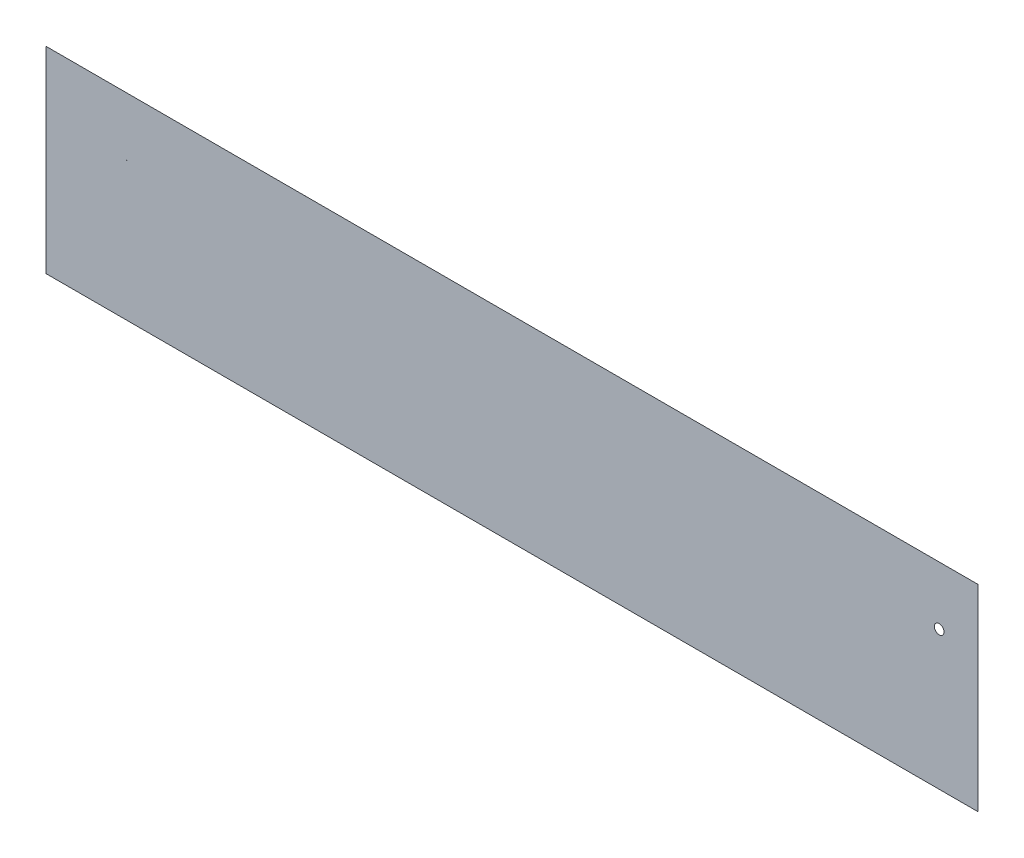
ISO-10303-21;
HEADER;
FILE_DESCRIPTION(('STEP AP214'),'2;1');
FILE_NAME('part.step','',(''),(''),'','','');
FILE_SCHEMA(('AUTOMOTIVE_DESIGN { 1 0 10303 214 1 1 1 1 }'));
ENDSEC;
DATA;
#1=APPLICATION_CONTEXT('core data for automotive mechanical design processes');
#2=APPLICATION_PROTOCOL_DEFINITION('international standard','automotive_design',2000,#1);
#3=PRODUCT_CONTEXT('',#1,'mechanical');
#4=PRODUCT('Part','Part','',(#3));
#5=PRODUCT_RELATED_PRODUCT_CATEGORY('part','',(#4));
#6=PRODUCT_DEFINITION_FORMATION('','',#4);
#7=PRODUCT_DEFINITION_CONTEXT('part definition',#1,'design');
#8=PRODUCT_DEFINITION('design','',#6,#7);
#9=PRODUCT_DEFINITION_SHAPE('','',#8);
#10=(LENGTH_UNIT() NAMED_UNIT(*) SI_UNIT(.MILLI.,.METRE.));
#11=(NAMED_UNIT(*) PLANE_ANGLE_UNIT() SI_UNIT($,.RADIAN.));
#12=(NAMED_UNIT(*) SI_UNIT($,.STERADIAN.) SOLID_ANGLE_UNIT());
#13=UNCERTAINTY_MEASURE_WITH_UNIT(LENGTH_MEASURE(1.E-05),#10,'distance_accuracy_value','');
#14=(GEOMETRIC_REPRESENTATION_CONTEXT(3) GLOBAL_UNCERTAINTY_ASSIGNED_CONTEXT((#13)) GLOBAL_UNIT_ASSIGNED_CONTEXT((#10,
#11,#12)) REPRESENTATION_CONTEXT('',''));
#15=CARTESIAN_POINT('',(0.,0.,0.));
#16=DIRECTION('',(0.,0.,1.));
#17=DIRECTION('',(1.,0.,0.));
#18=AXIS2_PLACEMENT_3D('',#15,#16,#17);
#19=CARTESIAN_POINT('',(0.,0.,0.000100076));
#20=DIRECTION('',(0.,0.,-1.));
#21=DIRECTION('',(-1.,0.,0.));
#22=AXIS2_PLACEMENT_3D('',#19,#20,#21);
#23=PLANE('',#22);
#24=DIRECTION('',(0.,-1.,0.));
#25=VECTOR('',#24,1.);
#26=CARTESIAN_POINT('',(0.,0.,0.000100076));
#27=LINE('',#26,#25);
#28=CARTESIAN_POINT('',(0.,128.778,0.000100076));
#29=VERTEX_POINT('',#28);
#30=CARTESIAN_POINT('',(0.,0.,0.000100076));
#31=VERTEX_POINT('',#30);
#32=EDGE_CURVE('E87',#29,#31,#27,.T.);
#33=ORIENTED_EDGE('',*,*,#32,.T.);
#34=DIRECTION('',(1.,0.,0.));
#35=VECTOR('',#34,1.);
#36=CARTESIAN_POINT('',(0.,0.,0.000100076));
#37=LINE('',#36,#35);
#38=CARTESIAN_POINT('',(609.6,0.,0.000100076));
#39=VERTEX_POINT('',#38);
#40=EDGE_CURVE('E82',#31,#39,#37,.T.);
#41=ORIENTED_EDGE('',*,*,#40,.T.);
#42=DIRECTION('',(0.,1.,0.));
#43=VECTOR('',#42,1.);
#44=CARTESIAN_POINT('',(609.6,0.,0.000100076));
#45=LINE('',#44,#43);
#46=CARTESIAN_POINT('',(609.6,128.778,0.000100076));
#47=VERTEX_POINT('',#46);
#48=EDGE_CURVE('E85',#39,#47,#45,.T.);
#49=ORIENTED_EDGE('',*,*,#48,.T.);
#50=DIRECTION('',(-1.,0.,0.));
#51=VECTOR('',#50,1.);
#52=CARTESIAN_POINT('',(0.,128.778,0.000100076));
#53=LINE('',#52,#51);
#54=EDGE_CURVE('E52',#47,#29,#53,.T.);
#55=ORIENTED_EDGE('',*,*,#54,.T.);
#56=EDGE_LOOP('',(#33,#41,#49,#55));
#57=FACE_BOUND('',#56,.T.);
#58=CARTESIAN_POINT('',(52.9746921364165,90.678,0.000100076));
#59=DIRECTION('',(0.,0.,1.));
#60=DIRECTION('',(1.,0.,0.));
#61=AXIS2_PLACEMENT_3D('',#58,#59,#60);
#62=CIRCLE('',#61,0.174798991152219);
#63=CARTESIAN_POINT('',(53.1494911275687,90.678,0.000100076));
#64=VERTEX_POINT('',#63);
#65=EDGE_CURVE('E102',#64,#64,#62,.T.);
#66=ORIENTED_EDGE('',*,*,#65,.F.);
#67=EDGE_LOOP('',(#66));
#68=FACE_BOUND('',#67,.T.);
#69=CARTESIAN_POINT('',(584.2,90.678,0.000100076));
#70=DIRECTION('',(0.,0.,1.));
#71=DIRECTION('',(1.,0.,0.));
#72=AXIS2_PLACEMENT_3D('',#69,#70,#71);
#73=CIRCLE('',#72,3.17500000000008);
#74=CARTESIAN_POINT('',(587.375,90.678,0.000100076));
#75=VERTEX_POINT('',#74);
#76=EDGE_CURVE('E117',#75,#75,#73,.T.);
#77=ORIENTED_EDGE('',*,*,#76,.F.);
#78=EDGE_LOOP('',(#77));
#79=FACE_BOUND('',#78,.T.);
#80=ADVANCED_FACE('F35',(#57,#68,#79),#23,.F.);
#81=CARTESIAN_POINT('',(0.,0.,0.));
#82=DIRECTION('',(0.,0.,-1.));
#83=DIRECTION('',(-1.,0.,0.));
#84=AXIS2_PLACEMENT_3D('',#81,#82,#83);
#85=PLANE('',#84);
#86=CARTESIAN_POINT('',(52.9746921364165,90.678,0.));
#87=DIRECTION('',(0.,0.,1.));
#88=DIRECTION('',(1.,0.,0.));
#89=AXIS2_PLACEMENT_3D('',#86,#87,#88);
#90=CIRCLE('',#89,0.174798991152219);
#91=CARTESIAN_POINT('',(53.1494911275687,90.678,0.));
#92=VERTEX_POINT('',#91);
#93=EDGE_CURVE('E114',#92,#92,#90,.T.);
#94=ORIENTED_EDGE('',*,*,#93,.T.);
#95=EDGE_LOOP('',(#94));
#96=FACE_BOUND('',#95,.T.);
#97=DIRECTION('',(0.,-1.,0.));
#98=VECTOR('',#97,1.);
#99=CARTESIAN_POINT('',(0.,0.,0.));
#100=LINE('',#99,#98);
#101=CARTESIAN_POINT('',(0.,128.778,0.));
#102=VERTEX_POINT('',#101);
#103=CARTESIAN_POINT('',(0.,0.,0.));
#104=VERTEX_POINT('',#103);
#105=EDGE_CURVE('E99',#102,#104,#100,.T.);
#106=ORIENTED_EDGE('',*,*,#105,.F.);
#107=DIRECTION('',(-1.,0.,0.));
#108=VECTOR('',#107,1.);
#109=CARTESIAN_POINT('',(0.,128.778,0.));
#110=LINE('',#109,#108);
#111=CARTESIAN_POINT('',(609.6,128.778,0.));
#112=VERTEX_POINT('',#111);
#113=EDGE_CURVE('E75',#112,#102,#110,.T.);
#114=ORIENTED_EDGE('',*,*,#113,.F.);
#115=DIRECTION('',(0.,1.,0.));
#116=VECTOR('',#115,1.);
#117=CARTESIAN_POINT('',(609.6,0.,0.));
#118=LINE('',#117,#116);
#119=CARTESIAN_POINT('',(609.6,0.,0.));
#120=VERTEX_POINT('',#119);
#121=EDGE_CURVE('E69',#120,#112,#118,.T.);
#122=ORIENTED_EDGE('',*,*,#121,.F.);
#123=DIRECTION('',(1.,0.,0.));
#124=VECTOR('',#123,1.);
#125=CARTESIAN_POINT('',(0.,0.,0.));
#126=LINE('',#125,#124);
#127=EDGE_CURVE('E91',#104,#120,#126,.T.);
#128=ORIENTED_EDGE('',*,*,#127,.F.);
#129=EDGE_LOOP('',(#106,#114,#122,#128));
#130=FACE_BOUND('',#129,.T.);
#131=CARTESIAN_POINT('',(584.2,90.678,0.));
#132=DIRECTION('',(0.,0.,1.));
#133=DIRECTION('',(1.,0.,0.));
#134=AXIS2_PLACEMENT_3D('',#131,#132,#133);
#135=CIRCLE('',#134,3.17500000000008);
#136=CARTESIAN_POINT('',(587.375,90.678,0.));
#137=VERTEX_POINT('',#136);
#138=EDGE_CURVE('E120',#137,#137,#135,.T.);
#139=ORIENTED_EDGE('',*,*,#138,.T.);
#140=EDGE_LOOP('',(#139));
#141=FACE_BOUND('',#140,.T.);
#142=ADVANCED_FACE('F110',(#96,#130,#141),#85,.T.);
#143=CARTESIAN_POINT('',(0.,0.,0.000100076));
#144=DIRECTION('',(1.,0.,0.));
#145=DIRECTION('',(0.,0.,-1.));
#146=AXIS2_PLACEMENT_3D('',#143,#144,#145);
#147=PLANE('',#146);
#148=ORIENTED_EDGE('',*,*,#105,.T.);
#149=DIRECTION('',(0.,0.,-1.));
#150=VECTOR('',#149,1.);
#151=CARTESIAN_POINT('',(0.,0.,0.000100076));
#152=LINE('',#151,#150);
#153=EDGE_CURVE('E11',#31,#104,#152,.T.);
#154=ORIENTED_EDGE('',*,*,#153,.F.);
#155=ORIENTED_EDGE('',*,*,#32,.F.);
#156=DIRECTION('',(0.,0.,-1.));
#157=VECTOR('',#156,1.);
#158=CARTESIAN_POINT('',(0.,128.778,0.000100076));
#159=LINE('',#158,#157);
#160=EDGE_CURVE('E95',#29,#102,#159,.T.);
#161=ORIENTED_EDGE('',*,*,#160,.T.);
#162=EDGE_LOOP('',(#148,#154,#155,#161));
#163=FACE_BOUND('',#162,.T.);
#164=ADVANCED_FACE('F37',(#163),#147,.F.);
#165=CARTESIAN_POINT('',(0.,0.,0.000100076));
#166=DIRECTION('',(0.,1.,0.));
#167=DIRECTION('',(0.,0.,1.));
#168=AXIS2_PLACEMENT_3D('',#165,#166,#167);
#169=PLANE('',#168);
#170=ORIENTED_EDGE('',*,*,#127,.T.);
#171=DIRECTION('',(0.,0.,-1.));
#172=VECTOR('',#171,1.);
#173=CARTESIAN_POINT('',(609.6,0.,0.000100076));
#174=LINE('',#173,#172);
#175=EDGE_CURVE('E44',#39,#120,#174,.T.);
#176=ORIENTED_EDGE('',*,*,#175,.F.);
#177=ORIENTED_EDGE('',*,*,#40,.F.);
#178=ORIENTED_EDGE('',*,*,#153,.T.);
#179=EDGE_LOOP('',(#170,#176,#177,#178));
#180=FACE_BOUND('',#179,.T.);
#181=ADVANCED_FACE('F90',(#180),#169,.F.);
#182=CARTESIAN_POINT('',(609.6,0.,0.000100076));
#183=DIRECTION('',(-1.,0.,0.));
#184=DIRECTION('',(0.,0.,1.));
#185=AXIS2_PLACEMENT_3D('',#182,#183,#184);
#186=PLANE('',#185);
#187=ORIENTED_EDGE('',*,*,#121,.T.);
#188=DIRECTION('',(0.,0.,-1.));
#189=VECTOR('',#188,1.);
#190=CARTESIAN_POINT('',(609.6,128.778,0.000100076));
#191=LINE('',#190,#189);
#192=EDGE_CURVE('E92',#47,#112,#191,.T.);
#193=ORIENTED_EDGE('',*,*,#192,.F.);
#194=ORIENTED_EDGE('',*,*,#48,.F.);
#195=ORIENTED_EDGE('',*,*,#175,.T.);
#196=EDGE_LOOP('',(#187,#193,#194,#195));
#197=FACE_BOUND('',#196,.T.);
#198=ADVANCED_FACE('F93',(#197),#186,.F.);
#199=CARTESIAN_POINT('',(0.,128.778,0.000100076));
#200=DIRECTION('',(0.,-1.,0.));
#201=DIRECTION('',(0.,0.,-1.));
#202=AXIS2_PLACEMENT_3D('',#199,#200,#201);
#203=PLANE('',#202);
#204=ORIENTED_EDGE('',*,*,#113,.T.);
#205=ORIENTED_EDGE('',*,*,#160,.F.);
#206=ORIENTED_EDGE('',*,*,#54,.F.);
#207=ORIENTED_EDGE('',*,*,#192,.T.);
#208=EDGE_LOOP('',(#204,#205,#206,#207));
#209=FACE_BOUND('',#208,.T.);
#210=ADVANCED_FACE('F107',(#209),#203,.F.);
#211=CARTESIAN_POINT('',(52.9746921364165,90.678,0.000100076));
#212=DIRECTION('',(0.,0.,-1.));
#213=DIRECTION('',(-1.,0.,0.));
#214=AXIS2_PLACEMENT_3D('',#211,#212,#213);
#215=CYLINDRICAL_SURFACE('',#214,0.174798991152219);
#216=ORIENTED_EDGE('',*,*,#65,.T.);
#217=EDGE_LOOP('',(#216));
#218=FACE_BOUND('',#217,.T.);
#219=ORIENTED_EDGE('',*,*,#93,.F.);
#220=EDGE_LOOP('',(#219));
#221=FACE_BOUND('',#220,.T.);
#222=ADVANCED_FACE('F137',(#218,#221),#215,.F.);
#223=CARTESIAN_POINT('',(584.2,90.678,0.000100076));
#224=DIRECTION('',(0.,0.,-1.));
#225=DIRECTION('',(-1.,0.,0.));
#226=AXIS2_PLACEMENT_3D('',#223,#224,#225);
#227=CYLINDRICAL_SURFACE('',#226,3.17500000000008);
#228=ORIENTED_EDGE('',*,*,#76,.T.);
#229=EDGE_LOOP('',(#228));
#230=FACE_BOUND('',#229,.T.);
#231=ORIENTED_EDGE('',*,*,#138,.F.);
#232=EDGE_LOOP('',(#231));
#233=FACE_BOUND('',#232,.T.);
#234=ADVANCED_FACE('F126',(#230,#233),#227,.F.);
#235=CLOSED_SHELL('',(#80,#142,#164,#181,#198,#210,#222,#234));
#236=MANIFOLD_SOLID_BREP('B2',#235);
#237=ADVANCED_BREP_SHAPE_REPRESENTATION('',(#18,#236),#14);
#238=SHAPE_DEFINITION_REPRESENTATION(#9,#237);
ENDSEC;
END-ISO-10303-21;
